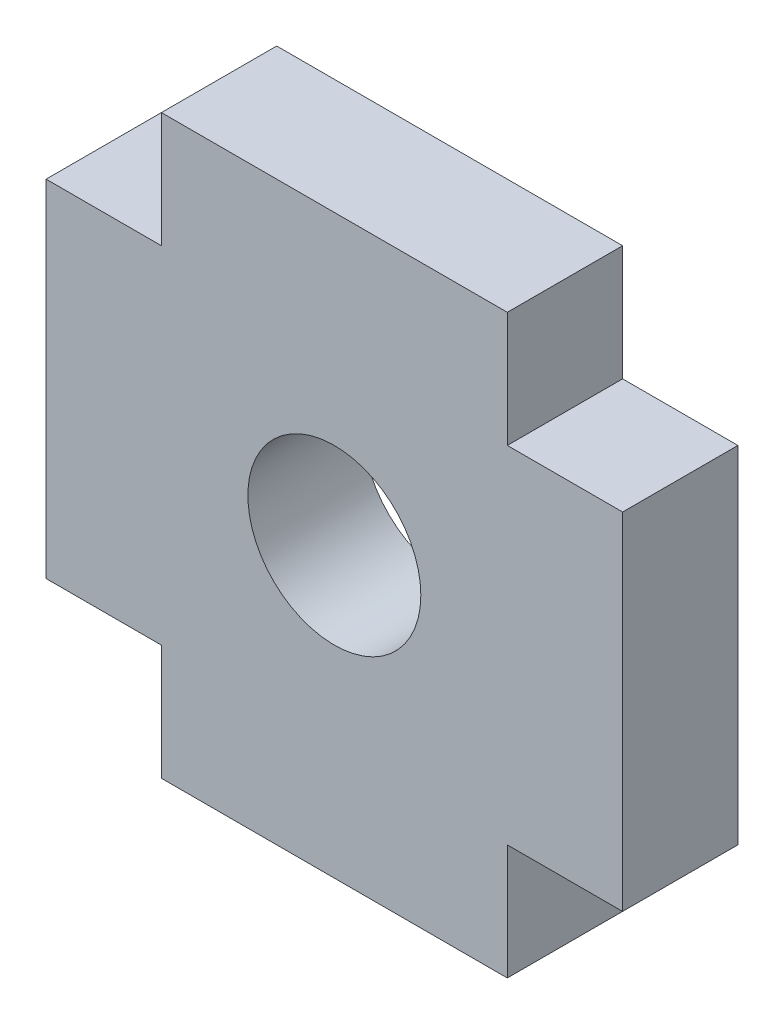
ISO-10303-21;
HEADER;
FILE_DESCRIPTION(('STEP AP214'),'2;1');
FILE_NAME('part.step','',(''),(''),'','','');
FILE_SCHEMA(('AUTOMOTIVE_DESIGN { 1 0 10303 214 1 1 1 1 }'));
ENDSEC;
DATA;
#1=APPLICATION_CONTEXT('core data for automotive mechanical design processes');
#2=APPLICATION_PROTOCOL_DEFINITION('international standard','automotive_design',2000,#1);
#3=PRODUCT_CONTEXT('',#1,'mechanical');
#4=PRODUCT('Part','Part','',(#3));
#5=PRODUCT_RELATED_PRODUCT_CATEGORY('part','',(#4));
#6=PRODUCT_DEFINITION_FORMATION('','',#4);
#7=PRODUCT_DEFINITION_CONTEXT('part definition',#1,'design');
#8=PRODUCT_DEFINITION('design','',#6,#7);
#9=PRODUCT_DEFINITION_SHAPE('','',#8);
#10=(LENGTH_UNIT() NAMED_UNIT(*) SI_UNIT(.MILLI.,.METRE.));
#11=(NAMED_UNIT(*) PLANE_ANGLE_UNIT() SI_UNIT($,.RADIAN.));
#12=(NAMED_UNIT(*) SI_UNIT($,.STERADIAN.) SOLID_ANGLE_UNIT());
#13=UNCERTAINTY_MEASURE_WITH_UNIT(LENGTH_MEASURE(1.E-05),#10,'distance_accuracy_value','');
#14=(GEOMETRIC_REPRESENTATION_CONTEXT(3) GLOBAL_UNCERTAINTY_ASSIGNED_CONTEXT((#13)) GLOBAL_UNIT_ASSIGNED_CONTEXT((#10,
#11,#12)) REPRESENTATION_CONTEXT('',''));
#15=CARTESIAN_POINT('',(0.,0.,0.));
#16=DIRECTION('',(0.,0.,1.));
#17=DIRECTION('',(1.,0.,0.));
#18=AXIS2_PLACEMENT_3D('',#15,#16,#17);
#19=CARTESIAN_POINT('',(0.,0.,2.));
#20=DIRECTION('',(0.,0.,1.));
#21=DIRECTION('',(1.,0.,0.));
#22=AXIS2_PLACEMENT_3D('',#19,#20,#21);
#23=PLANE('',#22);
#24=DIRECTION('',(0.,-1.,0.));
#25=VECTOR('',#24,1.);
#26=CARTESIAN_POINT('',(-4.99999999999989,3.00000000000034,2.));
#27=LINE('',#26,#25);
#28=CARTESIAN_POINT('',(-4.99999999999989,3.00000000000034,2.));
#29=VERTEX_POINT('',#28);
#30=CARTESIAN_POINT('',(-4.99999999999989,-2.99999999999989,2.));
#31=VERTEX_POINT('',#30);
#32=EDGE_CURVE('E178',#29,#31,#27,.T.);
#33=ORIENTED_EDGE('',*,*,#32,.T.);
#34=DIRECTION('',(1.,0.,0.));
#35=VECTOR('',#34,1.);
#36=CARTESIAN_POINT('',(-4.99999999999989,-2.99999999999989,2.));
#37=LINE('',#36,#35);
#38=CARTESIAN_POINT('',(-3.00000000000011,-2.99999999999989,2.));
#39=VERTEX_POINT('',#38);
#40=EDGE_CURVE('E106',#31,#39,#37,.T.);
#41=ORIENTED_EDGE('',*,*,#40,.T.);
#42=DIRECTION('',(0.,-1.,0.));
#43=VECTOR('',#42,1.);
#44=CARTESIAN_POINT('',(-3.00000000000011,-2.99999999999989,2.));
#45=LINE('',#44,#43);
#46=CARTESIAN_POINT('',(-3.00000000000011,-4.99999999999967,2.));
#47=VERTEX_POINT('',#46);
#48=EDGE_CURVE('E205',#39,#47,#45,.T.);
#49=ORIENTED_EDGE('',*,*,#48,.T.);
#50=DIRECTION('',(1.,0.,0.));
#51=VECTOR('',#50,1.);
#52=CARTESIAN_POINT('',(-3.00000000000011,-4.99999999999967,2.));
#53=LINE('',#52,#51);
#54=CARTESIAN_POINT('',(3.00000000000011,-4.99999999999967,2.));
#55=VERTEX_POINT('',#54);
#56=EDGE_CURVE('E224',#47,#55,#53,.T.);
#57=ORIENTED_EDGE('',*,*,#56,.T.);
#58=DIRECTION('',(0.,1.,0.));
#59=VECTOR('',#58,1.);
#60=CARTESIAN_POINT('',(3.00000000000011,-4.99999999999967,2.));
#61=LINE('',#60,#59);
#62=CARTESIAN_POINT('',(3.00000000000011,-2.99999999999989,2.));
#63=VERTEX_POINT('',#62);
#64=EDGE_CURVE('E221',#55,#63,#61,.T.);
#65=ORIENTED_EDGE('',*,*,#64,.T.);
#66=DIRECTION('',(1.,0.,0.));
#67=VECTOR('',#66,1.);
#68=CARTESIAN_POINT('',(4.99999999999989,-2.99999999999989,2.));
#69=LINE('',#68,#67);
#70=CARTESIAN_POINT('',(4.99999999999989,-2.99999999999989,2.));
#71=VERTEX_POINT('',#70);
#72=EDGE_CURVE('E223',#63,#71,#69,.T.);
#73=ORIENTED_EDGE('',*,*,#72,.T.);
#74=DIRECTION('',(0.,1.,0.));
#75=VECTOR('',#74,1.);
#76=CARTESIAN_POINT('',(4.99999999999989,3.00000000000034,2.));
#77=LINE('',#76,#75);
#78=CARTESIAN_POINT('',(4.99999999999989,3.00000000000034,2.));
#79=VERTEX_POINT('',#78);
#80=EDGE_CURVE('E226',#71,#79,#77,.T.);
#81=ORIENTED_EDGE('',*,*,#80,.T.);
#82=DIRECTION('',(-1.,0.,0.));
#83=VECTOR('',#82,1.);
#84=CARTESIAN_POINT('',(3.00000000000011,3.00000000000034,2.));
#85=LINE('',#84,#83);
#86=CARTESIAN_POINT('',(3.00000000000011,3.00000000000034,2.));
#87=VERTEX_POINT('',#86);
#88=EDGE_CURVE('E232',#79,#87,#85,.T.);
#89=ORIENTED_EDGE('',*,*,#88,.T.);
#90=DIRECTION('',(0.,1.,0.));
#91=VECTOR('',#90,1.);
#92=CARTESIAN_POINT('',(3.00000000000011,3.00000000000034,2.));
#93=LINE('',#92,#91);
#94=CARTESIAN_POINT('',(3.00000000000011,5.00000000000012,2.));
#95=VERTEX_POINT('',#94);
#96=EDGE_CURVE('E137',#87,#95,#93,.T.);
#97=ORIENTED_EDGE('',*,*,#96,.T.);
#98=DIRECTION('',(-1.,0.,0.));
#99=VECTOR('',#98,1.);
#100=CARTESIAN_POINT('',(3.00000000000011,5.00000000000012,2.));
#101=LINE('',#100,#99);
#102=CARTESIAN_POINT('',(-3.00000000000011,5.00000000000012,2.));
#103=VERTEX_POINT('',#102);
#104=EDGE_CURVE('E131',#95,#103,#101,.T.);
#105=ORIENTED_EDGE('',*,*,#104,.T.);
#106=DIRECTION('',(0.,-1.,0.));
#107=VECTOR('',#106,1.);
#108=CARTESIAN_POINT('',(-3.00000000000011,5.00000000000012,2.));
#109=LINE('',#108,#107);
#110=CARTESIAN_POINT('',(-3.00000000000011,3.00000000000034,2.));
#111=VERTEX_POINT('',#110);
#112=EDGE_CURVE('E135',#103,#111,#109,.T.);
#113=ORIENTED_EDGE('',*,*,#112,.T.);
#114=DIRECTION('',(-1.,0.,0.));
#115=VECTOR('',#114,1.);
#116=CARTESIAN_POINT('',(-3.00000000000011,3.00000000000034,2.));
#117=LINE('',#116,#115);
#118=EDGE_CURVE('E51',#111,#29,#117,.T.);
#119=ORIENTED_EDGE('',*,*,#118,.T.);
#120=EDGE_LOOP('',(#33,#41,#49,#57,#65,#73,#81,#89,#97,#105,#113,#119));
#121=FACE_BOUND('',#120,.T.);
#122=CARTESIAN_POINT('',(0.,0.,2.));
#123=DIRECTION('',(0.,0.,1.));
#124=DIRECTION('',(1.,0.,0.));
#125=AXIS2_PLACEMENT_3D('',#122,#123,#124);
#126=CIRCLE('',#125,1.50000000000006);
#127=CARTESIAN_POINT('',(1.50000000000006,0.,2.));
#128=VERTEX_POINT('',#127);
#129=EDGE_CURVE('E159',#128,#128,#126,.T.);
#130=ORIENTED_EDGE('',*,*,#129,.F.);
#131=EDGE_LOOP('',(#130));
#132=FACE_BOUND('',#131,.T.);
#133=ADVANCED_FACE('F34',(#121,#132),#23,.T.);
#134=CARTESIAN_POINT('',(0.,0.,0.));
#135=DIRECTION('',(0.,0.,1.));
#136=DIRECTION('',(1.,0.,0.));
#137=AXIS2_PLACEMENT_3D('',#134,#135,#136);
#138=PLANE('',#137);
#139=DIRECTION('',(0.,-1.,0.));
#140=VECTOR('',#139,1.);
#141=CARTESIAN_POINT('',(-4.99999999999989,3.00000000000034,0.));
#142=LINE('',#141,#140);
#143=CARTESIAN_POINT('',(-4.99999999999989,3.00000000000034,0.));
#144=VERTEX_POINT('',#143);
#145=CARTESIAN_POINT('',(-4.99999999999989,-2.99999999999989,0.));
#146=VERTEX_POINT('',#145);
#147=EDGE_CURVE('E155',#144,#146,#142,.T.);
#148=ORIENTED_EDGE('',*,*,#147,.F.);
#149=DIRECTION('',(-1.,0.,0.));
#150=VECTOR('',#149,1.);
#151=CARTESIAN_POINT('',(-3.00000000000011,3.00000000000034,0.));
#152=LINE('',#151,#150);
#153=CARTESIAN_POINT('',(-3.00000000000011,3.00000000000034,0.));
#154=VERTEX_POINT('',#153);
#155=EDGE_CURVE('E98',#154,#144,#152,.T.);
#156=ORIENTED_EDGE('',*,*,#155,.F.);
#157=DIRECTION('',(0.,-1.,0.));
#158=VECTOR('',#157,1.);
#159=CARTESIAN_POINT('',(-3.00000000000011,5.00000000000012,0.));
#160=LINE('',#159,#158);
#161=CARTESIAN_POINT('',(-3.00000000000011,5.00000000000012,0.));
#162=VERTEX_POINT('',#161);
#163=EDGE_CURVE('E92',#162,#154,#160,.T.);
#164=ORIENTED_EDGE('',*,*,#163,.F.);
#165=DIRECTION('',(-1.,0.,0.));
#166=VECTOR('',#165,1.);
#167=CARTESIAN_POINT('',(3.00000000000011,5.00000000000012,0.));
#168=LINE('',#167,#166);
#169=CARTESIAN_POINT('',(3.00000000000011,5.00000000000012,0.));
#170=VERTEX_POINT('',#169);
#171=EDGE_CURVE('E145',#170,#162,#168,.T.);
#172=ORIENTED_EDGE('',*,*,#171,.F.);
#173=DIRECTION('',(0.,1.,0.));
#174=VECTOR('',#173,1.);
#175=CARTESIAN_POINT('',(3.00000000000011,3.00000000000034,0.));
#176=LINE('',#175,#174);
#177=CARTESIAN_POINT('',(3.00000000000011,3.00000000000034,0.));
#178=VERTEX_POINT('',#177);
#179=EDGE_CURVE('E173',#178,#170,#176,.T.);
#180=ORIENTED_EDGE('',*,*,#179,.F.);
#181=DIRECTION('',(-1.,0.,0.));
#182=VECTOR('',#181,1.);
#183=CARTESIAN_POINT('',(3.00000000000011,3.00000000000034,0.));
#184=LINE('',#183,#182);
#185=CARTESIAN_POINT('',(4.99999999999989,3.00000000000034,0.));
#186=VERTEX_POINT('',#185);
#187=EDGE_CURVE('E171',#186,#178,#184,.T.);
#188=ORIENTED_EDGE('',*,*,#187,.F.);
#189=DIRECTION('',(0.,1.,0.));
#190=VECTOR('',#189,1.);
#191=CARTESIAN_POINT('',(4.99999999999989,3.00000000000034,0.));
#192=LINE('',#191,#190);
#193=CARTESIAN_POINT('',(4.99999999999989,-2.99999999999989,0.));
#194=VERTEX_POINT('',#193);
#195=EDGE_CURVE('E169',#194,#186,#192,.T.);
#196=ORIENTED_EDGE('',*,*,#195,.F.);
#197=DIRECTION('',(1.,0.,0.));
#198=VECTOR('',#197,1.);
#199=CARTESIAN_POINT('',(4.99999999999989,-2.99999999999989,0.));
#200=LINE('',#199,#198);
#201=CARTESIAN_POINT('',(3.00000000000011,-2.99999999999989,0.));
#202=VERTEX_POINT('',#201);
#203=EDGE_CURVE('E167',#202,#194,#200,.T.);
#204=ORIENTED_EDGE('',*,*,#203,.F.);
#205=DIRECTION('',(0.,1.,0.));
#206=VECTOR('',#205,1.);
#207=CARTESIAN_POINT('',(3.00000000000011,-4.99999999999967,0.));
#208=LINE('',#207,#206);
#209=CARTESIAN_POINT('',(3.00000000000011,-4.99999999999967,0.));
#210=VERTEX_POINT('',#209);
#211=EDGE_CURVE('E165',#210,#202,#208,.T.);
#212=ORIENTED_EDGE('',*,*,#211,.F.);
#213=DIRECTION('',(1.,0.,0.));
#214=VECTOR('',#213,1.);
#215=CARTESIAN_POINT('',(-3.00000000000011,-4.99999999999967,0.));
#216=LINE('',#215,#214);
#217=CARTESIAN_POINT('',(-3.00000000000011,-4.99999999999967,0.));
#218=VERTEX_POINT('',#217);
#219=EDGE_CURVE('E163',#218,#210,#216,.T.);
#220=ORIENTED_EDGE('',*,*,#219,.F.);
#221=DIRECTION('',(0.,-1.,0.));
#222=VECTOR('',#221,1.);
#223=CARTESIAN_POINT('',(-3.00000000000011,-2.99999999999989,0.));
#224=LINE('',#223,#222);
#225=CARTESIAN_POINT('',(-3.00000000000011,-2.99999999999989,0.));
#226=VERTEX_POINT('',#225);
#227=EDGE_CURVE('E161',#226,#218,#224,.T.);
#228=ORIENTED_EDGE('',*,*,#227,.F.);
#229=DIRECTION('',(1.,0.,0.));
#230=VECTOR('',#229,1.);
#231=CARTESIAN_POINT('',(-4.99999999999989,-2.99999999999989,0.));
#232=LINE('',#231,#230);
#233=EDGE_CURVE('E158',#146,#226,#232,.T.);
#234=ORIENTED_EDGE('',*,*,#233,.F.);
#235=EDGE_LOOP('',(#148,#156,#164,#172,#180,#188,#196,#204,#212,#220,#228,#234));
#236=FACE_BOUND('',#235,.T.);
#237=CARTESIAN_POINT('',(0.,0.,0.));
#238=DIRECTION('',(0.,0.,1.));
#239=DIRECTION('',(1.,0.,0.));
#240=AXIS2_PLACEMENT_3D('',#237,#238,#239);
#241=CIRCLE('',#240,1.50000000000006);
#242=CARTESIAN_POINT('',(1.50000000000006,0.,0.));
#243=VERTEX_POINT('',#242);
#244=EDGE_CURVE('E379',#243,#243,#241,.T.);
#245=ORIENTED_EDGE('',*,*,#244,.T.);
#246=EDGE_LOOP('',(#245));
#247=FACE_BOUND('',#246,.T.);
#248=ADVANCED_FACE('F209',(#236,#247),#138,.F.);
#249=CARTESIAN_POINT('',(-4.99999999999989,3.00000000000034,2.));
#250=DIRECTION('',(1.,0.,0.));
#251=DIRECTION('',(0.,1.,0.));
#252=AXIS2_PLACEMENT_3D('',#249,#250,#251);
#253=PLANE('',#252);
#254=ORIENTED_EDGE('',*,*,#147,.T.);
#255=DIRECTION('',(0.,0.,-1.));
#256=VECTOR('',#255,1.);
#257=CARTESIAN_POINT('',(-4.99999999999989,-2.99999999999989,2.));
#258=LINE('',#257,#256);
#259=EDGE_CURVE('E11',#31,#146,#258,.T.);
#260=ORIENTED_EDGE('',*,*,#259,.F.);
#261=ORIENTED_EDGE('',*,*,#32,.F.);
#262=DIRECTION('',(0.,0.,-1.));
#263=VECTOR('',#262,1.);
#264=CARTESIAN_POINT('',(-4.99999999999989,3.00000000000034,2.));
#265=LINE('',#264,#263);
#266=EDGE_CURVE('E151',#29,#144,#265,.T.);
#267=ORIENTED_EDGE('',*,*,#266,.T.);
#268=EDGE_LOOP('',(#254,#260,#261,#267));
#269=FACE_BOUND('',#268,.T.);
#270=ADVANCED_FACE('F36',(#269),#253,.F.);
#271=CARTESIAN_POINT('',(-4.99999999999989,-2.99999999999989,2.));
#272=DIRECTION('',(0.,1.,0.));
#273=DIRECTION('',(-1.,0.,0.));
#274=AXIS2_PLACEMENT_3D('',#271,#272,#273);
#275=PLANE('',#274);
#276=ORIENTED_EDGE('',*,*,#233,.T.);
#277=DIRECTION('',(0.,0.,-1.));
#278=VECTOR('',#277,1.);
#279=CARTESIAN_POINT('',(-3.00000000000011,-2.99999999999989,2.));
#280=LINE('',#279,#278);
#281=EDGE_CURVE('E43',#39,#226,#280,.T.);
#282=ORIENTED_EDGE('',*,*,#281,.F.);
#283=ORIENTED_EDGE('',*,*,#40,.F.);
#284=ORIENTED_EDGE('',*,*,#259,.T.);
#285=EDGE_LOOP('',(#276,#282,#283,#284));
#286=FACE_BOUND('',#285,.T.);
#287=ADVANCED_FACE('F266',(#286),#275,.F.);
#288=CARTESIAN_POINT('',(-3.00000000000011,-2.99999999999989,2.));
#289=DIRECTION('',(1.,0.,0.));
#290=DIRECTION('',(0.,1.,0.));
#291=AXIS2_PLACEMENT_3D('',#288,#289,#290);
#292=PLANE('',#291);
#293=ORIENTED_EDGE('',*,*,#227,.T.);
#294=DIRECTION('',(0.,0.,-1.));
#295=VECTOR('',#294,1.);
#296=CARTESIAN_POINT('',(-3.00000000000011,-4.99999999999967,2.));
#297=LINE('',#296,#295);
#298=EDGE_CURVE('E197',#47,#218,#297,.T.);
#299=ORIENTED_EDGE('',*,*,#298,.F.);
#300=ORIENTED_EDGE('',*,*,#48,.F.);
#301=ORIENTED_EDGE('',*,*,#281,.T.);
#302=EDGE_LOOP('',(#293,#299,#300,#301));
#303=FACE_BOUND('',#302,.T.);
#304=ADVANCED_FACE('F203',(#303),#292,.F.);
#305=CARTESIAN_POINT('',(-3.00000000000011,-4.99999999999967,2.));
#306=DIRECTION('',(0.,1.,0.));
#307=DIRECTION('',(0.,0.,1.));
#308=AXIS2_PLACEMENT_3D('',#305,#306,#307);
#309=PLANE('',#308);
#310=ORIENTED_EDGE('',*,*,#219,.T.);
#311=DIRECTION('',(0.,0.,-1.));
#312=VECTOR('',#311,1.);
#313=CARTESIAN_POINT('',(3.00000000000011,-4.99999999999967,2.));
#314=LINE('',#313,#312);
#315=EDGE_CURVE('E194',#55,#210,#314,.T.);
#316=ORIENTED_EDGE('',*,*,#315,.F.);
#317=ORIENTED_EDGE('',*,*,#56,.F.);
#318=ORIENTED_EDGE('',*,*,#298,.T.);
#319=EDGE_LOOP('',(#310,#316,#317,#318));
#320=FACE_BOUND('',#319,.T.);
#321=ADVANCED_FACE('F215',(#320),#309,.F.);
#322=CARTESIAN_POINT('',(3.00000000000011,-4.99999999999967,2.));
#323=DIRECTION('',(-1.,0.,0.));
#324=DIRECTION('',(0.,0.,1.));
#325=AXIS2_PLACEMENT_3D('',#322,#323,#324);
#326=PLANE('',#325);
#327=ORIENTED_EDGE('',*,*,#211,.T.);
#328=DIRECTION('',(0.,0.,-1.));
#329=VECTOR('',#328,1.);
#330=CARTESIAN_POINT('',(3.00000000000011,-2.99999999999989,2.));
#331=LINE('',#330,#329);
#332=EDGE_CURVE('E191',#63,#202,#331,.T.);
#333=ORIENTED_EDGE('',*,*,#332,.F.);
#334=ORIENTED_EDGE('',*,*,#64,.F.);
#335=ORIENTED_EDGE('',*,*,#315,.T.);
#336=EDGE_LOOP('',(#327,#333,#334,#335));
#337=FACE_BOUND('',#336,.T.);
#338=ADVANCED_FACE('F219',(#337),#326,.F.);
#339=CARTESIAN_POINT('',(4.99999999999989,-2.99999999999989,2.));
#340=DIRECTION('',(0.,1.,0.));
#341=DIRECTION('',(-1.,0.,0.));
#342=AXIS2_PLACEMENT_3D('',#339,#340,#341);
#343=PLANE('',#342);
#344=ORIENTED_EDGE('',*,*,#203,.T.);
#345=DIRECTION('',(0.,0.,-1.));
#346=VECTOR('',#345,1.);
#347=CARTESIAN_POINT('',(4.99999999999989,-2.99999999999989,2.));
#348=LINE('',#347,#346);
#349=EDGE_CURVE('E188',#71,#194,#348,.T.);
#350=ORIENTED_EDGE('',*,*,#349,.F.);
#351=ORIENTED_EDGE('',*,*,#72,.F.);
#352=ORIENTED_EDGE('',*,*,#332,.T.);
#353=EDGE_LOOP('',(#344,#350,#351,#352));
#354=FACE_BOUND('',#353,.T.);
#355=ADVANCED_FACE('F279',(#354),#343,.F.);
#356=CARTESIAN_POINT('',(4.99999999999989,3.00000000000034,2.));
#357=DIRECTION('',(-1.,0.,0.));
#358=DIRECTION('',(0.,-1.,0.));
#359=AXIS2_PLACEMENT_3D('',#356,#357,#358);
#360=PLANE('',#359);
#361=ORIENTED_EDGE('',*,*,#195,.T.);
#362=DIRECTION('',(0.,0.,-1.));
#363=VECTOR('',#362,1.);
#364=CARTESIAN_POINT('',(4.99999999999989,3.00000000000034,2.));
#365=LINE('',#364,#363);
#366=EDGE_CURVE('E185',#79,#186,#365,.T.);
#367=ORIENTED_EDGE('',*,*,#366,.F.);
#368=ORIENTED_EDGE('',*,*,#80,.F.);
#369=ORIENTED_EDGE('',*,*,#349,.T.);
#370=EDGE_LOOP('',(#361,#367,#368,#369));
#371=FACE_BOUND('',#370,.T.);
#372=ADVANCED_FACE('F282',(#371),#360,.F.);
#373=CARTESIAN_POINT('',(3.00000000000011,3.00000000000034,2.));
#374=DIRECTION('',(0.,-1.,0.));
#375=DIRECTION('',(0.,0.,-1.));
#376=AXIS2_PLACEMENT_3D('',#373,#374,#375);
#377=PLANE('',#376);
#378=ORIENTED_EDGE('',*,*,#187,.T.);
#379=DIRECTION('',(0.,0.,-1.));
#380=VECTOR('',#379,1.);
#381=CARTESIAN_POINT('',(3.00000000000011,3.00000000000034,2.));
#382=LINE('',#381,#380);
#383=EDGE_CURVE('E182',#87,#178,#382,.T.);
#384=ORIENTED_EDGE('',*,*,#383,.F.);
#385=ORIENTED_EDGE('',*,*,#88,.F.);
#386=ORIENTED_EDGE('',*,*,#366,.T.);
#387=EDGE_LOOP('',(#378,#384,#385,#386));
#388=FACE_BOUND('',#387,.T.);
#389=ADVANCED_FACE('F238',(#388),#377,.F.);
#390=CARTESIAN_POINT('',(3.00000000000011,3.00000000000034,2.));
#391=DIRECTION('',(-1.,0.,0.));
#392=DIRECTION('',(0.,0.,1.));
#393=AXIS2_PLACEMENT_3D('',#390,#391,#392);
#394=PLANE('',#393);
#395=ORIENTED_EDGE('',*,*,#179,.T.);
#396=DIRECTION('',(0.,0.,-1.));
#397=VECTOR('',#396,1.);
#398=CARTESIAN_POINT('',(3.00000000000011,5.00000000000012,2.));
#399=LINE('',#398,#397);
#400=EDGE_CURVE('E146',#95,#170,#399,.T.);
#401=ORIENTED_EDGE('',*,*,#400,.F.);
#402=ORIENTED_EDGE('',*,*,#96,.F.);
#403=ORIENTED_EDGE('',*,*,#383,.T.);
#404=EDGE_LOOP('',(#395,#401,#402,#403));
#405=FACE_BOUND('',#404,.T.);
#406=ADVANCED_FACE('F242',(#405),#394,.F.);
#407=CARTESIAN_POINT('',(3.00000000000011,5.00000000000012,2.));
#408=DIRECTION('',(0.,-1.,0.));
#409=DIRECTION('',(0.,0.,-1.));
#410=AXIS2_PLACEMENT_3D('',#407,#408,#409);
#411=PLANE('',#410);
#412=ORIENTED_EDGE('',*,*,#171,.T.);
#413=DIRECTION('',(0.,0.,-1.));
#414=VECTOR('',#413,1.);
#415=CARTESIAN_POINT('',(-3.00000000000011,5.00000000000012,2.));
#416=LINE('',#415,#414);
#417=EDGE_CURVE('E142',#103,#162,#416,.T.);
#418=ORIENTED_EDGE('',*,*,#417,.F.);
#419=ORIENTED_EDGE('',*,*,#104,.F.);
#420=ORIENTED_EDGE('',*,*,#400,.T.);
#421=EDGE_LOOP('',(#412,#418,#419,#420));
#422=FACE_BOUND('',#421,.T.);
#423=ADVANCED_FACE('F143',(#422),#411,.F.);
#424=CARTESIAN_POINT('',(-3.00000000000011,5.00000000000012,2.));
#425=DIRECTION('',(1.,0.,0.));
#426=DIRECTION('',(0.,0.,-1.));
#427=AXIS2_PLACEMENT_3D('',#424,#425,#426);
#428=PLANE('',#427);
#429=ORIENTED_EDGE('',*,*,#163,.T.);
#430=DIRECTION('',(0.,0.,-1.));
#431=VECTOR('',#430,1.);
#432=CARTESIAN_POINT('',(-3.00000000000011,3.00000000000034,2.));
#433=LINE('',#432,#431);
#434=EDGE_CURVE('E147',#111,#154,#433,.T.);
#435=ORIENTED_EDGE('',*,*,#434,.F.);
#436=ORIENTED_EDGE('',*,*,#112,.F.);
#437=ORIENTED_EDGE('',*,*,#417,.T.);
#438=EDGE_LOOP('',(#429,#435,#436,#437));
#439=FACE_BOUND('',#438,.T.);
#440=ADVANCED_FACE('F149',(#439),#428,.F.);
#441=CARTESIAN_POINT('',(-3.00000000000011,3.00000000000034,2.));
#442=DIRECTION('',(0.,-1.,0.));
#443=DIRECTION('',(0.,0.,-1.));
#444=AXIS2_PLACEMENT_3D('',#441,#442,#443);
#445=PLANE('',#444);
#446=ORIENTED_EDGE('',*,*,#155,.T.);
#447=ORIENTED_EDGE('',*,*,#266,.F.);
#448=ORIENTED_EDGE('',*,*,#118,.F.);
#449=ORIENTED_EDGE('',*,*,#434,.T.);
#450=EDGE_LOOP('',(#446,#447,#448,#449));
#451=FACE_BOUND('',#450,.T.);
#452=ADVANCED_FACE('F246',(#451),#445,.F.);
#453=CARTESIAN_POINT('',(0.,0.,2.));
#454=DIRECTION('',(0.,0.,-1.));
#455=DIRECTION('',(-1.,0.,0.));
#456=AXIS2_PLACEMENT_3D('',#453,#454,#455);
#457=CYLINDRICAL_SURFACE('',#456,1.50000000000006);
#458=ORIENTED_EDGE('',*,*,#129,.T.);
#459=EDGE_LOOP('',(#458));
#460=FACE_BOUND('',#459,.T.);
#461=ORIENTED_EDGE('',*,*,#244,.F.);
#462=EDGE_LOOP('',(#461));
#463=FACE_BOUND('',#462,.T.);
#464=ADVANCED_FACE('F248',(#460,#463),#457,.F.);
#465=CLOSED_SHELL('',(#133,#248,#270,#287,#304,#321,#338,#355,#372,#389,#406,#423,#440,#452,#464));
#466=MANIFOLD_SOLID_BREP('B2',#465);
#467=ADVANCED_BREP_SHAPE_REPRESENTATION('',(#18,#466),#14);
#468=SHAPE_DEFINITION_REPRESENTATION(#9,#467);
ENDSEC;
END-ISO-10303-21;
